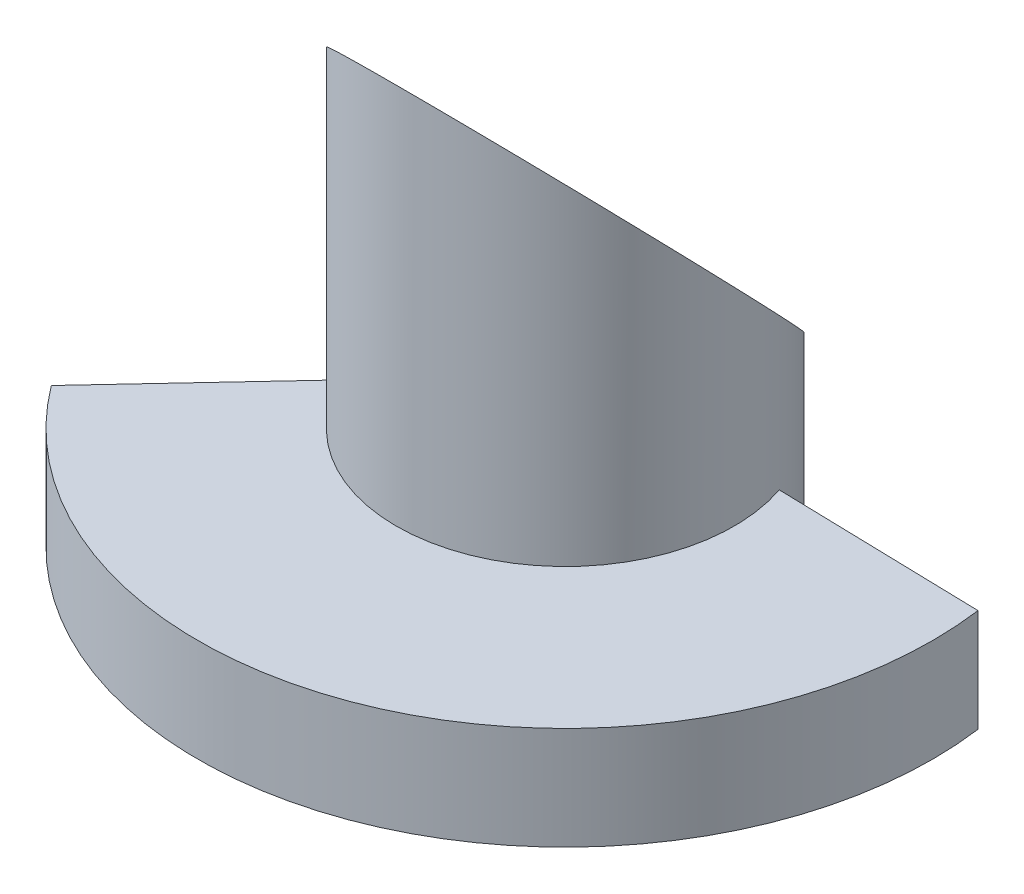
ISO-10303-21;
HEADER;
FILE_DESCRIPTION(('STEP AP214'),'2;1');
FILE_NAME('part.step','',(''),(''),'','','');
FILE_SCHEMA(('AUTOMOTIVE_DESIGN { 1 0 10303 214 1 1 1 1 }'));
ENDSEC;
DATA;
#1=APPLICATION_CONTEXT('core data for automotive mechanical design processes');
#2=APPLICATION_PROTOCOL_DEFINITION('international standard','automotive_design',2000,#1);
#3=PRODUCT_CONTEXT('',#1,'mechanical');
#4=PRODUCT('Part','Part','',(#3));
#5=PRODUCT_RELATED_PRODUCT_CATEGORY('part','',(#4));
#6=PRODUCT_DEFINITION_FORMATION('','',#4);
#7=PRODUCT_DEFINITION_CONTEXT('part definition',#1,'design');
#8=PRODUCT_DEFINITION('design','',#6,#7);
#9=PRODUCT_DEFINITION_SHAPE('','',#8);
#10=(LENGTH_UNIT() NAMED_UNIT(*) SI_UNIT(.MILLI.,.METRE.));
#11=(NAMED_UNIT(*) PLANE_ANGLE_UNIT() SI_UNIT($,.RADIAN.));
#12=(NAMED_UNIT(*) SI_UNIT($,.STERADIAN.) SOLID_ANGLE_UNIT());
#13=UNCERTAINTY_MEASURE_WITH_UNIT(LENGTH_MEASURE(1.E-05),#10,'distance_accuracy_value','');
#14=(GEOMETRIC_REPRESENTATION_CONTEXT(3) GLOBAL_UNCERTAINTY_ASSIGNED_CONTEXT((#13)) GLOBAL_UNIT_ASSIGNED_CONTEXT((#10,
#11,#12)) REPRESENTATION_CONTEXT('',''));
#15=CARTESIAN_POINT('',(0.,0.,0.));
#16=DIRECTION('',(0.,0.,1.));
#17=DIRECTION('',(1.,0.,0.));
#18=AXIS2_PLACEMENT_3D('',#15,#16,#17);
#19=CARTESIAN_POINT('',(0.,7.,0.));
#20=DIRECTION('',(0.,-1.,0.));
#21=DIRECTION('',(0.,0.,-1.));
#22=AXIS2_PLACEMENT_3D('',#19,#20,#21);
#23=CYLINDRICAL_SURFACE('',#22,11.5);
#24=CARTESIAN_POINT('',(0.,0.,0.));
#25=DIRECTION('',(0.,1.,0.));
#26=DIRECTION('',(0.,0.,1.));
#27=AXIS2_PLACEMENT_3D('',#24,#25,#26);
#28=CIRCLE('',#27,11.5);
#29=CARTESIAN_POINT('',(10.8967305088304,0.,-3.67576716046114));
#30=VERTEX_POINT('',#29);
#31=CARTESIAN_POINT('',(-10.4823709237297,0.,4.72968284532333));
#32=VERTEX_POINT('',#31);
#33=EDGE_CURVE('E99',#30,#32,#28,.T.);
#34=ORIENTED_EDGE('',*,*,#33,.T.);
#35=DIRECTION('',(0.,-1.,0.));
#36=VECTOR('',#35,1.);
#37=CARTESIAN_POINT('',(-10.4823709237297,7.,4.72968284532333));
#38=LINE('',#37,#36);
#39=CARTESIAN_POINT('',(-10.4823709237297,7.,4.72968284532333));
#40=VERTEX_POINT('',#39);
#41=EDGE_CURVE('E44',#40,#32,#38,.T.);
#42=ORIENTED_EDGE('',*,*,#41,.F.);
#43=CARTESIAN_POINT('',(0.,7.,0.));
#44=DIRECTION('',(0.,1.,0.));
#45=DIRECTION('',(0.,0.,1.));
#46=AXIS2_PLACEMENT_3D('',#43,#44,#45);
#47=CIRCLE('',#46,11.5);
#48=CARTESIAN_POINT('',(10.8967305088304,7.,-3.67576716046114));
#49=VERTEX_POINT('',#48);
#50=EDGE_CURVE('E11',#40,#49,#47,.T.);
#51=ORIENTED_EDGE('',*,*,#50,.T.);
#52=DIRECTION('',(0.,-1.,0.));
#53=VECTOR('',#52,1.);
#54=CARTESIAN_POINT('',(10.8967305088304,7.,-3.67576716046114));
#55=LINE('',#54,#53);
#56=EDGE_CURVE('E82',#49,#30,#55,.T.);
#57=ORIENTED_EDGE('',*,*,#56,.T.);
#58=EDGE_LOOP('',(#34,#42,#51,#57));
#59=FACE_BOUND('',#58,.T.);
#60=CARTESIAN_POINT('',(0.,21.0914013914087,0.));
#61=DIRECTION('',(0.,0.694658370459004,-0.719339800338645));
#62=DIRECTION('',(0.,-0.719339800338645,-0.694658370459004));
#63=AXIS2_PLACEMENT_3D('',#60,#61,#62);
#64=ELLIPSE('',#63,16.5549002056957,11.5);
#65=CARTESIAN_POINT('',(0.,9.18280278281736,-11.5));
#66=VERTEX_POINT('',#65);
#67=EDGE_CURVE('E121',#66,#66,#64,.T.);
#68=ORIENTED_EDGE('',*,*,#67,.F.);
#69=EDGE_LOOP('',(#68));
#70=FACE_BOUND('',#69,.T.);
#71=ADVANCED_FACE('F41',(#59,#70),#23,.T.);
#72=CARTESIAN_POINT('',(-3.23473745420142,7.,-3.02372669814217));
#73=DIRECTION('',(0.730532529413773,0.,0.682877897920496));
#74=DIRECTION('',(0.682877897920496,0.,-0.730532529413773));
#75=AXIS2_PLACEMENT_3D('',#72,#73,#74);
#76=PLANE('',#75);
#77=DIRECTION('',(-0.682877897920496,0.,0.730532529413773));
#78=VECTOR('',#77,1.);
#79=CARTESIAN_POINT('',(-3.23473745420142,0.,-3.02372669814217));
#80=LINE('',#79,#78);
#81=CARTESIAN_POINT('',(-20.0367750247653,0.,14.9508409999887));
#82=VERTEX_POINT('',#81);
#83=EDGE_CURVE('E117',#32,#82,#80,.T.);
#84=ORIENTED_EDGE('',*,*,#83,.T.);
#85=DIRECTION('',(0.,-1.,0.));
#86=VECTOR('',#85,1.);
#87=CARTESIAN_POINT('',(-20.0367750247653,7.,14.9508409999887));
#88=LINE('',#87,#86);
#89=CARTESIAN_POINT('',(-20.0367750247653,7.,14.9508409999887));
#90=VERTEX_POINT('',#89);
#91=EDGE_CURVE('E102',#90,#82,#88,.T.);
#92=ORIENTED_EDGE('',*,*,#91,.F.);
#93=DIRECTION('',(-0.682877897920496,0.,0.730532529413773));
#94=VECTOR('',#93,1.);
#95=CARTESIAN_POINT('',(-3.23473745420142,7.,-3.02372669814217));
#96=LINE('',#95,#94);
#97=EDGE_CURVE('E113',#40,#90,#96,.T.);
#98=ORIENTED_EDGE('',*,*,#97,.F.);
#99=ORIENTED_EDGE('',*,*,#41,.T.);
#100=EDGE_LOOP('',(#84,#92,#98,#99));
#101=FACE_BOUND('',#100,.T.);
#102=ADVANCED_FACE('F133',(#101),#76,.F.);
#103=CARTESIAN_POINT('',(0.,7.,0.));
#104=DIRECTION('',(0.,-1.,0.));
#105=DIRECTION('',(0.,0.,-1.));
#106=AXIS2_PLACEMENT_3D('',#103,#104,#105);
#107=CYLINDRICAL_SURFACE('',#106,25.);
#108=CARTESIAN_POINT('',(0.,0.,0.));
#109=DIRECTION('',(0.,1.,0.));
#110=DIRECTION('',(0.,0.,1.));
#111=AXIS2_PLACEMENT_3D('',#108,#109,#110);
#112=CIRCLE('',#111,25.);
#113=CARTESIAN_POINT('',(24.7782357276786,0.,-3.32250420971787));
#114=VERTEX_POINT('',#113);
#115=EDGE_CURVE('E114',#82,#114,#112,.T.);
#116=ORIENTED_EDGE('',*,*,#115,.T.);
#117=DIRECTION('',(0.,-1.,0.));
#118=VECTOR('',#117,1.);
#119=CARTESIAN_POINT('',(24.7782357276786,7.,-3.32250420971787));
#120=LINE('',#119,#118);
#121=CARTESIAN_POINT('',(24.7782357276786,7.,-3.32250420971787));
#122=VERTEX_POINT('',#121);
#123=EDGE_CURVE('E76',#122,#114,#120,.T.);
#124=ORIENTED_EDGE('',*,*,#123,.F.);
#125=CARTESIAN_POINT('',(0.,7.,0.));
#126=DIRECTION('',(0.,1.,0.));
#127=DIRECTION('',(0.,0.,1.));
#128=AXIS2_PLACEMENT_3D('',#125,#126,#127);
#129=CIRCLE('',#128,25.);
#130=EDGE_CURVE('E59',#90,#122,#129,.T.);
#131=ORIENTED_EDGE('',*,*,#130,.F.);
#132=ORIENTED_EDGE('',*,*,#91,.T.);
#133=EDGE_LOOP('',(#116,#124,#131,#132));
#134=FACE_BOUND('',#133,.T.);
#135=ADVANCED_FACE('F137',(#134),#107,.T.);
#136=CARTESIAN_POINT('',(0.100534496676887,7.,-3.95051373872685));
#137=DIRECTION('',(0.0254402249533499,0.,-0.999676345100915));
#138=DIRECTION('',(-0.999676345100915,0.,-0.0254402249533499));
#139=AXIS2_PLACEMENT_3D('',#136,#137,#138);
#140=PLANE('',#139);
#141=DIRECTION('',(0.999676345100915,0.,0.0254402249533499));
#142=VECTOR('',#141,1.);
#143=CARTESIAN_POINT('',(0.100534496676887,0.,-3.95051373872685));
#144=LINE('',#143,#142);
#145=EDGE_CURVE('E93',#30,#114,#144,.T.);
#146=ORIENTED_EDGE('',*,*,#145,.F.);
#147=ORIENTED_EDGE('',*,*,#56,.F.);
#148=DIRECTION('',(0.999676345100915,0.,0.0254402249533499));
#149=VECTOR('',#148,1.);
#150=CARTESIAN_POINT('',(0.100534496676887,7.,-3.95051373872685));
#151=LINE('',#150,#149);
#152=EDGE_CURVE('E87',#49,#122,#151,.T.);
#153=ORIENTED_EDGE('',*,*,#152,.T.);
#154=ORIENTED_EDGE('',*,*,#123,.T.);
#155=EDGE_LOOP('',(#146,#147,#153,#154));
#156=FACE_BOUND('',#155,.T.);
#157=ADVANCED_FACE('F91',(#156),#140,.T.);
#158=CARTESIAN_POINT('',(0.,7.,0.));
#159=DIRECTION('',(0.,1.,0.));
#160=DIRECTION('',(0.,0.,1.));
#161=AXIS2_PLACEMENT_3D('',#158,#159,#160);
#162=PLANE('',#161);
#163=ORIENTED_EDGE('',*,*,#50,.F.);
#164=ORIENTED_EDGE('',*,*,#97,.T.);
#165=ORIENTED_EDGE('',*,*,#130,.T.);
#166=ORIENTED_EDGE('',*,*,#152,.F.);
#167=EDGE_LOOP('',(#163,#164,#165,#166));
#168=FACE_BOUND('',#167,.T.);
#169=ADVANCED_FACE('F88',(#168),#162,.T.);
#170=CARTESIAN_POINT('',(0.,0.,0.));
#171=DIRECTION('',(0.,1.,0.));
#172=DIRECTION('',(0.,0.,1.));
#173=AXIS2_PLACEMENT_3D('',#170,#171,#172);
#174=PLANE('',#173);
#175=ORIENTED_EDGE('',*,*,#33,.F.);
#176=ORIENTED_EDGE('',*,*,#145,.T.);
#177=ORIENTED_EDGE('',*,*,#115,.F.);
#178=ORIENTED_EDGE('',*,*,#83,.F.);
#179=EDGE_LOOP('',(#175,#176,#177,#178));
#180=FACE_BOUND('',#179,.T.);
#181=ADVANCED_FACE('F145',(#180),#174,.F.);
#182=CARTESIAN_POINT('',(26.,10.1776610490492,-10.5392765397758));
#183=DIRECTION('',(0.,0.694658370459004,-0.719339800338645));
#184=DIRECTION('',(0.,0.719339800338645,0.694658370459004));
#185=AXIS2_PLACEMENT_3D('',#182,#183,#184);
#186=PLANE('',#185);
#187=ORIENTED_EDGE('',*,*,#67,.T.);
#188=EDGE_LOOP('',(#187));
#189=FACE_BOUND('',#188,.T.);
#190=ADVANCED_FACE('F131',(#189),#186,.T.);
#191=CLOSED_SHELL('',(#71,#102,#135,#157,#169,#181,#190));
#192=MANIFOLD_SOLID_BREP('B2',#191);
#193=ADVANCED_BREP_SHAPE_REPRESENTATION('',(#18,#192),#14);
#194=SHAPE_DEFINITION_REPRESENTATION(#9,#193);
ENDSEC;
END-ISO-10303-21;
